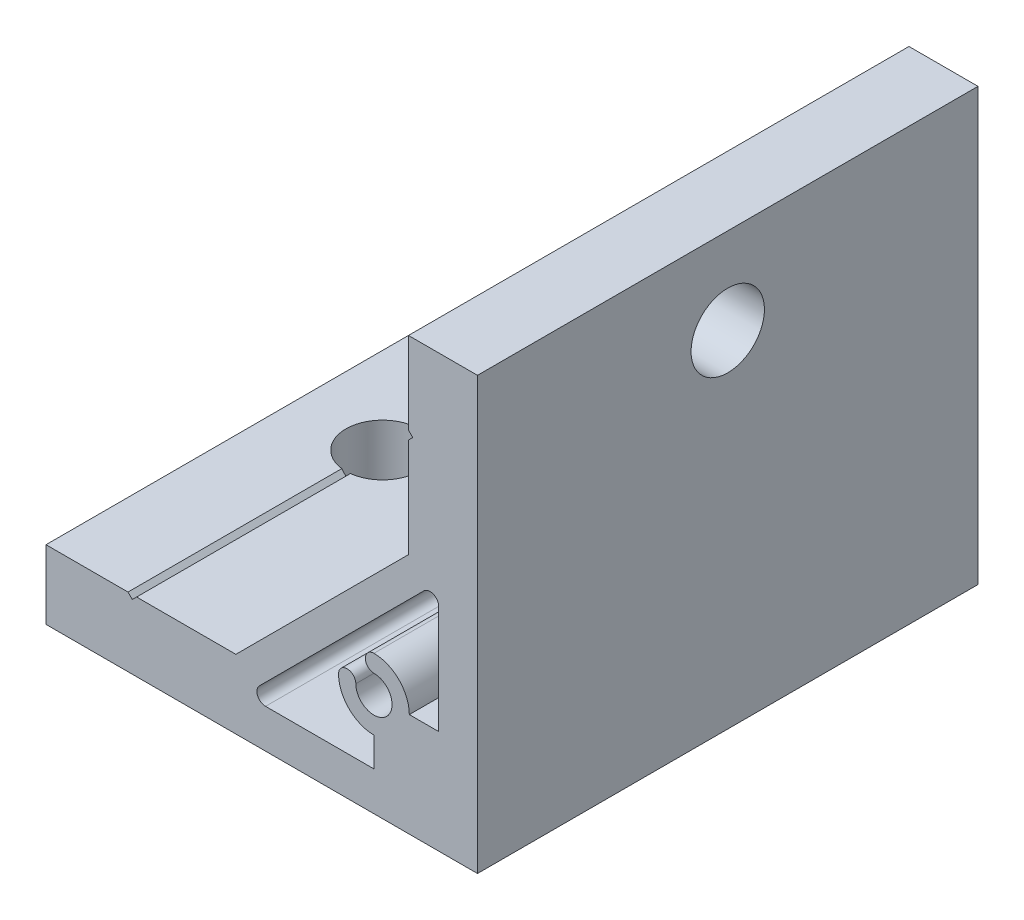
ISO-10303-21;
HEADER;
FILE_DESCRIPTION(('STEP AP214'),'2;1');
FILE_NAME('part.step','',(''),(''),'','','');
FILE_SCHEMA(('AUTOMOTIVE_DESIGN { 1 0 10303 214 1 1 1 1 }'));
ENDSEC;
DATA;
#1=APPLICATION_CONTEXT('core data for automotive mechanical design processes');
#2=APPLICATION_PROTOCOL_DEFINITION('international standard','automotive_design',2000,#1);
#3=PRODUCT_CONTEXT('',#1,'mechanical');
#4=PRODUCT('Part','Part','',(#3));
#5=PRODUCT_RELATED_PRODUCT_CATEGORY('part','',(#4));
#6=PRODUCT_DEFINITION_FORMATION('','',#4);
#7=PRODUCT_DEFINITION_CONTEXT('part definition',#1,'design');
#8=PRODUCT_DEFINITION('design','',#6,#7);
#9=PRODUCT_DEFINITION_SHAPE('','',#8);
#10=(LENGTH_UNIT() NAMED_UNIT(*) SI_UNIT(.MILLI.,.METRE.));
#11=(NAMED_UNIT(*) PLANE_ANGLE_UNIT() SI_UNIT($,.RADIAN.));
#12=(NAMED_UNIT(*) SI_UNIT($,.STERADIAN.) SOLID_ANGLE_UNIT());
#13=UNCERTAINTY_MEASURE_WITH_UNIT(LENGTH_MEASURE(1.E-05),#10,'distance_accuracy_value','');
#14=(GEOMETRIC_REPRESENTATION_CONTEXT(3) GLOBAL_UNCERTAINTY_ASSIGNED_CONTEXT((#13)) GLOBAL_UNIT_ASSIGNED_CONTEXT((#10,
#11,#12)) REPRESENTATION_CONTEXT('',''));
#15=CARTESIAN_POINT('',(0.,0.,0.));
#16=DIRECTION('',(0.,0.,1.));
#17=DIRECTION('',(1.,0.,0.));
#18=AXIS2_PLACEMENT_3D('',#15,#16,#17);
#19=CARTESIAN_POINT('',(-39.5,8.00000000000008,29.));
#20=DIRECTION('',(0.707106781186547,-0.707106781186547,0.));
#21=DIRECTION('',(0.707106781186548,0.707106781186548,0.));
#22=AXIS2_PLACEMENT_3D('',#19,#20,#21);
#23=PLANE('',#22);
#24=DIRECTION('',(0.,0.,-1.));
#25=VECTOR('',#24,1.);
#26=CARTESIAN_POINT('',(-39.5,8.00000000000008,29.));
#27=LINE('',#26,#25);
#28=CARTESIAN_POINT('',(-39.5,8.00000000000008,29.));
#29=VERTEX_POINT('',#28);
#30=CARTESIAN_POINT('',(-39.5,8.00000000000009,4.22048575403354));
#31=VERTEX_POINT('',#30);
#32=EDGE_CURVE('E264',#29,#31,#27,.T.);
#33=ORIENTED_EDGE('',*,*,#32,.T.);
#34=CARTESIAN_POINT('',(-40.,7.50000000000008,0.));
#35=DIRECTION('',(0.707106781186547,-0.707106781186547,0.));
#36=DIRECTION('',(0.707106781186548,0.707106781186548,0.));
#37=AXIS2_PLACEMENT_3D('',#34,#35,#36);
#38=ELLIPSE('',#37,6.01040764008561,4.25000000000001);
#39=CARTESIAN_POINT('',(-40.,7.50000000000008,4.25000000000001));
#40=VERTEX_POINT('',#39);
#41=EDGE_CURVE('E249',#31,#40,#38,.T.);
#42=ORIENTED_EDGE('',*,*,#41,.T.);
#43=DIRECTION('',(0.,0.,-1.));
#44=VECTOR('',#43,1.);
#45=CARTESIAN_POINT('',(-40.,7.50000000000008,29.));
#46=LINE('',#45,#44);
#47=CARTESIAN_POINT('',(-40.,7.50000000000008,29.));
#48=VERTEX_POINT('',#47);
#49=EDGE_CURVE('E248',#48,#40,#46,.T.);
#50=ORIENTED_EDGE('',*,*,#49,.F.);
#51=DIRECTION('',(-0.707106781186547,-0.707106781186547,0.));
#52=VECTOR('',#51,1.);
#53=CARTESIAN_POINT('',(-39.5,8.00000000000008,29.));
#54=LINE('',#53,#52);
#55=EDGE_CURVE('E365',#29,#48,#54,.T.);
#56=ORIENTED_EDGE('',*,*,#55,.F.);
#57=EDGE_LOOP('',(#33,#42,#50,#56));
#58=FACE_BOUND('',#57,.T.);
#59=ADVANCED_FACE('F34',(#58),#23,.F.);
#60=CARTESIAN_POINT('',(-40.,7.50000000000008,29.));
#61=DIRECTION('',(-0.707106781186549,-0.707106781186546,0.));
#62=DIRECTION('',(0.707106781186546,-0.707106781186549,0.));
#63=AXIS2_PLACEMENT_3D('',#60,#61,#62);
#64=PLANE('',#63);
#65=DIRECTION('',(0.,0.,-1.));
#66=VECTOR('',#65,1.);
#67=CARTESIAN_POINT('',(-40.5,8.00000000000008,29.));
#68=LINE('',#67,#66);
#69=CARTESIAN_POINT('',(-40.5,8.00000000000008,-4.22048575403354));
#70=VERTEX_POINT('',#69);
#71=CARTESIAN_POINT('',(-40.5,8.00000000000008,-29.));
#72=VERTEX_POINT('',#71);
#73=EDGE_CURVE('E256',#70,#72,#68,.T.);
#74=ORIENTED_EDGE('',*,*,#73,.F.);
#75=CARTESIAN_POINT('',(-40.,7.50000000000007,0.));
#76=DIRECTION('',(-0.707106781186549,-0.707106781186546,0.));
#77=DIRECTION('',(-0.707106781186546,0.707106781186549,0.));
#78=AXIS2_PLACEMENT_3D('',#75,#76,#77);
#79=ELLIPSE('',#78,6.01040764008572,4.25000000000001);
#80=CARTESIAN_POINT('',(-40.,7.50000000000008,-4.25));
#81=VERTEX_POINT('',#80);
#82=EDGE_CURVE('E49',#70,#81,#79,.T.);
#83=ORIENTED_EDGE('',*,*,#82,.T.);
#84=CARTESIAN_POINT('',(-40.,7.50000000000008,-29.));
#85=VERTEX_POINT('',#84);
#86=EDGE_CURVE('E255',#81,#85,#46,.T.);
#87=ORIENTED_EDGE('',*,*,#86,.T.);
#88=DIRECTION('',(-0.707106781186546,0.707106781186549,0.));
#89=VECTOR('',#88,1.);
#90=CARTESIAN_POINT('',(-40.,7.50000000000008,-29.));
#91=LINE('',#90,#89);
#92=EDGE_CURVE('E332',#85,#72,#91,.T.);
#93=ORIENTED_EDGE('',*,*,#92,.T.);
#94=EDGE_LOOP('',(#74,#83,#87,#93));
#95=FACE_BOUND('',#94,.T.);
#96=ADVANCED_FACE('F414',(#95),#64,.F.);
#97=CARTESIAN_POINT('',(-8.00000000000042,40.5,29.));
#98=DIRECTION('',(0.707106781186549,0.707106781186546,0.));
#99=DIRECTION('',(-0.707106781186546,0.707106781186549,0.));
#100=AXIS2_PLACEMENT_3D('',#97,#98,#99);
#101=PLANE('',#100);
#102=DIRECTION('',(0.,0.,-1.));
#103=VECTOR('',#102,1.);
#104=CARTESIAN_POINT('',(-8.00000000000042,40.5,29.));
#105=LINE('',#104,#103);
#106=CARTESIAN_POINT('',(-8.00000000000042,40.5,29.));
#107=VERTEX_POINT('',#106);
#108=CARTESIAN_POINT('',(-8.00000000000042,40.5,4.22048575403354));
#109=VERTEX_POINT('',#108);
#110=EDGE_CURVE('E282',#107,#109,#105,.T.);
#111=ORIENTED_EDGE('',*,*,#110,.T.);
#112=CARTESIAN_POINT('',(-7.50000000000042,40.,0.));
#113=DIRECTION('',(0.707106781186549,0.707106781186546,0.));
#114=DIRECTION('',(-0.707106781186546,0.707106781186549,0.));
#115=AXIS2_PLACEMENT_3D('',#112,#113,#114);
#116=ELLIPSE('',#115,6.01040764008585,4.25);
#117=CARTESIAN_POINT('',(-7.50000000000042,40.,4.25));
#118=VERTEX_POINT('',#117);
#119=EDGE_CURVE('E452',#109,#118,#116,.T.);
#120=ORIENTED_EDGE('',*,*,#119,.T.);
#121=DIRECTION('',(0.,0.,-1.));
#122=VECTOR('',#121,1.);
#123=CARTESIAN_POINT('',(-7.50000000000042,40.,29.));
#124=LINE('',#123,#122);
#125=CARTESIAN_POINT('',(-7.50000000000042,40.,29.));
#126=VERTEX_POINT('',#125);
#127=EDGE_CURVE('E278',#126,#118,#124,.T.);
#128=ORIENTED_EDGE('',*,*,#127,.F.);
#129=DIRECTION('',(0.707106781186546,-0.707106781186549,0.));
#130=VECTOR('',#129,1.);
#131=CARTESIAN_POINT('',(-8.00000000000042,40.5,29.));
#132=LINE('',#131,#130);
#133=EDGE_CURVE('E355',#107,#126,#132,.T.);
#134=ORIENTED_EDGE('',*,*,#133,.F.);
#135=EDGE_LOOP('',(#111,#120,#128,#134));
#136=FACE_BOUND('',#135,.T.);
#137=ADVANCED_FACE('F421',(#136),#101,.F.);
#138=CARTESIAN_POINT('',(-7.50000000000042,40.,29.));
#139=DIRECTION('',(0.707106781186549,-0.707106781186546,0.));
#140=DIRECTION('',(0.707106781186546,0.707106781186549,0.));
#141=AXIS2_PLACEMENT_3D('',#138,#139,#140);
#142=PLANE('',#141);
#143=DIRECTION('',(0.,0.,-1.));
#144=VECTOR('',#143,1.);
#145=CARTESIAN_POINT('',(-8.00000000000042,39.5,29.));
#146=LINE('',#145,#144);
#147=CARTESIAN_POINT('',(-8.00000000000042,39.5,-4.22048575403353));
#148=VERTEX_POINT('',#147);
#149=CARTESIAN_POINT('',(-8.00000000000042,39.5,-29.));
#150=VERTEX_POINT('',#149);
#151=EDGE_CURVE('E273',#148,#150,#146,.T.);
#152=ORIENTED_EDGE('',*,*,#151,.F.);
#153=CARTESIAN_POINT('',(-7.50000000000043,40.,0.));
#154=DIRECTION('',(0.707106781186549,-0.707106781186546,0.));
#155=DIRECTION('',(-0.707106781186546,-0.707106781186549,0.));
#156=AXIS2_PLACEMENT_3D('',#153,#154,#155);
#157=ELLIPSE('',#156,6.01040764008544,4.25);
#158=CARTESIAN_POINT('',(-7.50000000000042,40.,-4.24999999999999));
#159=VERTEX_POINT('',#158);
#160=EDGE_CURVE('E56',#148,#159,#157,.T.);
#161=ORIENTED_EDGE('',*,*,#160,.T.);
#162=CARTESIAN_POINT('',(-7.50000000000042,40.,-29.));
#163=VERTEX_POINT('',#162);
#164=EDGE_CURVE('E277',#159,#163,#124,.T.);
#165=ORIENTED_EDGE('',*,*,#164,.T.);
#166=DIRECTION('',(-0.707106781186546,-0.707106781186549,0.));
#167=VECTOR('',#166,1.);
#168=CARTESIAN_POINT('',(-7.50000000000042,40.,-29.));
#169=LINE('',#168,#167);
#170=EDGE_CURVE('E307',#163,#150,#169,.T.);
#171=ORIENTED_EDGE('',*,*,#170,.T.);
#172=EDGE_LOOP('',(#152,#161,#165,#171));
#173=FACE_BOUND('',#172,.T.);
#174=ADVANCED_FACE('F304',(#173),#142,.F.);
#175=CARTESIAN_POINT('',(0.,0.,29.));
#176=DIRECTION('',(0.,0.,1.));
#177=DIRECTION('',(1.,0.,0.));
#178=AXIS2_PLACEMENT_3D('',#175,#176,#177);
#179=PLANE('',#178);
#180=DIRECTION('',(0.,-1.,0.));
#181=VECTOR('',#180,1.);
#182=CARTESIAN_POINT('',(-50.,8.,29.));
#183=LINE('',#182,#181);
#184=CARTESIAN_POINT('',(-50.,8.,29.));
#185=VERTEX_POINT('',#184);
#186=CARTESIAN_POINT('',(-50.,0.,29.));
#187=VERTEX_POINT('',#186);
#188=EDGE_CURVE('E335',#185,#187,#183,.T.);
#189=ORIENTED_EDGE('',*,*,#188,.T.);
#190=DIRECTION('',(1.,0.,0.));
#191=VECTOR('',#190,1.);
#192=CARTESIAN_POINT('',(-50.,0.,29.));
#193=LINE('',#192,#191);
#194=CARTESIAN_POINT('',(0.,0.,29.));
#195=VERTEX_POINT('',#194);
#196=EDGE_CURVE('E339',#187,#195,#193,.T.);
#197=ORIENTED_EDGE('',*,*,#196,.T.);
#198=DIRECTION('',(0.,1.,0.));
#199=VECTOR('',#198,1.);
#200=CARTESIAN_POINT('',(0.,0.,29.));
#201=LINE('',#200,#199);
#202=CARTESIAN_POINT('',(0.,50.,29.));
#203=VERTEX_POINT('',#202);
#204=EDGE_CURVE('E344',#195,#203,#201,.T.);
#205=ORIENTED_EDGE('',*,*,#204,.T.);
#206=DIRECTION('',(-1.,0.,0.));
#207=VECTOR('',#206,1.);
#208=CARTESIAN_POINT('',(0.,50.,29.));
#209=LINE('',#208,#207);
#210=CARTESIAN_POINT('',(-8.00000000000009,50.,29.));
#211=VERTEX_POINT('',#210);
#212=EDGE_CURVE('E351',#203,#211,#209,.T.);
#213=ORIENTED_EDGE('',*,*,#212,.T.);
#214=DIRECTION('',(0.,-1.,0.));
#215=VECTOR('',#214,1.);
#216=CARTESIAN_POINT('',(-8.00000000000009,50.,29.));
#217=LINE('',#216,#215);
#218=EDGE_CURVE('E353',#211,#107,#217,.T.);
#219=ORIENTED_EDGE('',*,*,#218,.T.);
#220=ORIENTED_EDGE('',*,*,#133,.T.);
#221=DIRECTION('',(-0.707106781186546,-0.707106781186549,0.));
#222=VECTOR('',#221,1.);
#223=CARTESIAN_POINT('',(-7.50000000000042,40.,29.));
#224=LINE('',#223,#222);
#225=CARTESIAN_POINT('',(-8.00000000000042,39.5,29.));
#226=VERTEX_POINT('',#225);
#227=EDGE_CURVE('E357',#126,#226,#224,.T.);
#228=ORIENTED_EDGE('',*,*,#227,.T.);
#229=DIRECTION('',(0.,-1.,0.));
#230=VECTOR('',#229,1.);
#231=CARTESIAN_POINT('',(-8.00000000000042,39.5,29.));
#232=LINE('',#231,#230);
#233=CARTESIAN_POINT('',(-8.00000000000017,28.,29.));
#234=VERTEX_POINT('',#233);
#235=EDGE_CURVE('E359',#226,#234,#232,.T.);
#236=ORIENTED_EDGE('',*,*,#235,.T.);
#237=DIRECTION('',(-0.707106781186546,-0.707106781186549,0.));
#238=VECTOR('',#237,1.);
#239=CARTESIAN_POINT('',(-8.00000000000017,28.,29.));
#240=LINE('',#239,#238);
#241=CARTESIAN_POINT('',(-28.,8.00000000000008,29.));
#242=VERTEX_POINT('',#241);
#243=EDGE_CURVE('E361',#234,#242,#240,.T.);
#244=ORIENTED_EDGE('',*,*,#243,.T.);
#245=DIRECTION('',(-1.,0.,0.));
#246=VECTOR('',#245,1.);
#247=CARTESIAN_POINT('',(-28.,8.00000000000008,29.));
#248=LINE('',#247,#246);
#249=EDGE_CURVE('E363',#242,#29,#248,.T.);
#250=ORIENTED_EDGE('',*,*,#249,.T.);
#251=ORIENTED_EDGE('',*,*,#55,.T.);
#252=DIRECTION('',(-0.707106781186546,0.707106781186549,0.));
#253=VECTOR('',#252,1.);
#254=CARTESIAN_POINT('',(-40.,7.50000000000008,29.));
#255=LINE('',#254,#253);
#256=CARTESIAN_POINT('',(-40.5,8.00000000000008,29.));
#257=VERTEX_POINT('',#256);
#258=EDGE_CURVE('E367',#48,#257,#255,.T.);
#259=ORIENTED_EDGE('',*,*,#258,.T.);
#260=DIRECTION('',(-1.,0.,0.));
#261=VECTOR('',#260,1.);
#262=CARTESIAN_POINT('',(-40.5,8.00000000000008,29.));
#263=LINE('',#262,#261);
#264=EDGE_CURVE('E254',#257,#185,#263,.T.);
#265=ORIENTED_EDGE('',*,*,#264,.T.);
#266=EDGE_LOOP('',(#189,#197,#205,#213,#219,#220,#228,#236,#244,#250,#251,#259,#265));
#267=FACE_BOUND('',#266,.T.);
#268=DIRECTION('',(0.,1.,0.));
#269=VECTOR('',#268,1.);
#270=CARTESIAN_POINT('',(-4.5,12.,29.));
#271=LINE('',#270,#269);
#272=CARTESIAN_POINT('',(-4.5,12.,29.));
#273=VERTEX_POINT('',#272);
#274=CARTESIAN_POINT('',(-4.5,24.5603030380332,29.));
#275=VERTEX_POINT('',#274);
#276=EDGE_CURVE('E458',#273,#275,#271,.T.);
#277=ORIENTED_EDGE('',*,*,#276,.F.);
#278=DIRECTION('',(1.,0.,0.));
#279=VECTOR('',#278,1.);
#280=CARTESIAN_POINT('',(-7.9,12.,29.));
#281=LINE('',#280,#279);
#282=CARTESIAN_POINT('',(-7.9,12.,29.));
#283=VERTEX_POINT('',#282);
#284=EDGE_CURVE('E456',#283,#273,#281,.T.);
#285=ORIENTED_EDGE('',*,*,#284,.F.);
#286=CARTESIAN_POINT('',(-12.,12.,29.));
#287=DIRECTION('',(0.,0.,-1.));
#288=DIRECTION('',(-1.,0.,0.));
#289=AXIS2_PLACEMENT_3D('',#286,#287,#288);
#290=CIRCLE('',#289,4.1);
#291=CARTESIAN_POINT('',(-12.,16.1,29.));
#292=VERTEX_POINT('',#291);
#293=EDGE_CURVE('E480',#292,#283,#290,.T.);
#294=ORIENTED_EDGE('',*,*,#293,.F.);
#295=CARTESIAN_POINT('',(-12.,15.1,29.));
#296=DIRECTION('',(0.,0.,-1.));
#297=DIRECTION('',(-1.,0.,0.));
#298=AXIS2_PLACEMENT_3D('',#295,#296,#297);
#299=CIRCLE('',#298,1.);
#300=CARTESIAN_POINT('',(-12.,14.1,29.));
#301=VERTEX_POINT('',#300);
#302=EDGE_CURVE('E477',#301,#292,#299,.T.);
#303=ORIENTED_EDGE('',*,*,#302,.F.);
#304=CARTESIAN_POINT('',(-12.,12.,29.));
#305=DIRECTION('',(0.,0.,1.));
#306=DIRECTION('',(1.,0.,0.));
#307=AXIS2_PLACEMENT_3D('',#304,#305,#306);
#308=CIRCLE('',#307,2.1);
#309=CARTESIAN_POINT('',(-14.1,12.,29.));
#310=VERTEX_POINT('',#309);
#311=EDGE_CURVE('E475',#310,#301,#308,.T.);
#312=ORIENTED_EDGE('',*,*,#311,.F.);
#313=CARTESIAN_POINT('',(-15.1,12.,29.));
#314=DIRECTION('',(0.,0.,-1.));
#315=DIRECTION('',(-1.,0.,0.));
#316=AXIS2_PLACEMENT_3D('',#313,#314,#315);
#317=CIRCLE('',#316,1.);
#318=CARTESIAN_POINT('',(-16.1,12.,29.));
#319=VERTEX_POINT('',#318);
#320=EDGE_CURVE('E473',#319,#310,#317,.T.);
#321=ORIENTED_EDGE('',*,*,#320,.F.);
#322=CARTESIAN_POINT('',(-12.,12.,29.));
#323=DIRECTION('',(0.,0.,-1.));
#324=DIRECTION('',(-1.,0.,0.));
#325=AXIS2_PLACEMENT_3D('',#322,#323,#324);
#326=CIRCLE('',#325,4.1);
#327=CARTESIAN_POINT('',(-12.,7.9,29.));
#328=VERTEX_POINT('',#327);
#329=EDGE_CURVE('E471',#328,#319,#326,.T.);
#330=ORIENTED_EDGE('',*,*,#329,.F.);
#331=DIRECTION('',(0.,1.,0.));
#332=VECTOR('',#331,1.);
#333=CARTESIAN_POINT('',(-12.,4.5,29.));
#334=LINE('',#333,#332);
#335=CARTESIAN_POINT('',(-12.,4.5,29.));
#336=VERTEX_POINT('',#335);
#337=EDGE_CURVE('E469',#336,#328,#334,.T.);
#338=ORIENTED_EDGE('',*,*,#337,.F.);
#339=DIRECTION('',(1.,0.,0.));
#340=VECTOR('',#339,1.);
#341=CARTESIAN_POINT('',(-24.5603030380331,4.5,29.));
#342=LINE('',#341,#340);
#343=CARTESIAN_POINT('',(-24.5603030380331,4.5,29.));
#344=VERTEX_POINT('',#343);
#345=EDGE_CURVE('E467',#344,#336,#342,.T.);
#346=ORIENTED_EDGE('',*,*,#345,.F.);
#347=CARTESIAN_POINT('',(-24.5603030380331,5.5,29.));
#348=DIRECTION('',(0.,0.,1.));
#349=DIRECTION('',(1.,0.,0.));
#350=AXIS2_PLACEMENT_3D('',#347,#348,#349);
#351=CIRCLE('',#350,1.);
#352=CARTESIAN_POINT('',(-25.2674098192196,6.20710678118655,29.));
#353=VERTEX_POINT('',#352);
#354=EDGE_CURVE('E465',#353,#344,#351,.T.);
#355=ORIENTED_EDGE('',*,*,#354,.F.);
#356=DIRECTION('',(-0.707106781186546,-0.707106781186549,0.));
#357=VECTOR('',#356,1.);
#358=CARTESIAN_POINT('',(-6.20710678118655,25.2674098192197,29.));
#359=LINE('',#358,#357);
#360=CARTESIAN_POINT('',(-6.20710678118655,25.2674098192197,29.));
#361=VERTEX_POINT('',#360);
#362=EDGE_CURVE('E463',#361,#353,#359,.T.);
#363=ORIENTED_EDGE('',*,*,#362,.F.);
#364=CARTESIAN_POINT('',(-5.5,24.5603030380332,29.));
#365=DIRECTION('',(0.,0.,1.));
#366=DIRECTION('',(1.,0.,0.));
#367=AXIS2_PLACEMENT_3D('',#364,#365,#366);
#368=CIRCLE('',#367,0.999999999999999);
#369=EDGE_CURVE('E461',#275,#361,#368,.T.);
#370=ORIENTED_EDGE('',*,*,#369,.F.);
#371=EDGE_LOOP('',(#277,#285,#294,#303,#312,#321,#330,#338,#346,#355,#363,#370));
#372=FACE_BOUND('',#371,.T.);
#373=ADVANCED_FACE('F411',(#267,#372),#179,.T.);
#374=CARTESIAN_POINT('',(0.,0.,-29.));
#375=DIRECTION('',(0.,0.,1.));
#376=DIRECTION('',(1.,0.,0.));
#377=AXIS2_PLACEMENT_3D('',#374,#375,#376);
#378=PLANE('',#377);
#379=DIRECTION('',(0.,-1.,0.));
#380=VECTOR('',#379,1.);
#381=CARTESIAN_POINT('',(-50.,8.,-29.));
#382=LINE('',#381,#380);
#383=CARTESIAN_POINT('',(-50.,8.,-29.));
#384=VERTEX_POINT('',#383);
#385=CARTESIAN_POINT('',(-50.,0.,-29.));
#386=VERTEX_POINT('',#385);
#387=EDGE_CURVE('E370',#384,#386,#382,.T.);
#388=ORIENTED_EDGE('',*,*,#387,.F.);
#389=DIRECTION('',(-1.,0.,0.));
#390=VECTOR('',#389,1.);
#391=CARTESIAN_POINT('',(-40.5,8.00000000000008,-29.));
#392=LINE('',#391,#390);
#393=EDGE_CURVE('E334',#72,#384,#392,.T.);
#394=ORIENTED_EDGE('',*,*,#393,.F.);
#395=ORIENTED_EDGE('',*,*,#92,.F.);
#396=DIRECTION('',(-0.707106781186547,-0.707106781186547,0.));
#397=VECTOR('',#396,1.);
#398=CARTESIAN_POINT('',(-39.5,8.00000000000008,-29.));
#399=LINE('',#398,#397);
#400=CARTESIAN_POINT('',(-39.5,8.00000000000008,-29.));
#401=VERTEX_POINT('',#400);
#402=EDGE_CURVE('E329',#401,#85,#399,.T.);
#403=ORIENTED_EDGE('',*,*,#402,.F.);
#404=DIRECTION('',(-1.,0.,0.));
#405=VECTOR('',#404,1.);
#406=CARTESIAN_POINT('',(-28.,8.00000000000008,-29.));
#407=LINE('',#406,#405);
#408=CARTESIAN_POINT('',(-28.,8.00000000000008,-29.));
#409=VERTEX_POINT('',#408);
#410=EDGE_CURVE('E323',#409,#401,#407,.T.);
#411=ORIENTED_EDGE('',*,*,#410,.F.);
#412=DIRECTION('',(-0.707106781186546,-0.707106781186549,0.));
#413=VECTOR('',#412,1.);
#414=CARTESIAN_POINT('',(-8.00000000000017,28.,-29.));
#415=LINE('',#414,#413);
#416=CARTESIAN_POINT('',(-8.00000000000017,28.,-29.));
#417=VERTEX_POINT('',#416);
#418=EDGE_CURVE('E320',#417,#409,#415,.T.);
#419=ORIENTED_EDGE('',*,*,#418,.F.);
#420=DIRECTION('',(0.,-1.,0.));
#421=VECTOR('',#420,1.);
#422=CARTESIAN_POINT('',(-8.00000000000042,39.5,-29.));
#423=LINE('',#422,#421);
#424=EDGE_CURVE('E312',#150,#417,#423,.T.);
#425=ORIENTED_EDGE('',*,*,#424,.F.);
#426=ORIENTED_EDGE('',*,*,#170,.F.);
#427=DIRECTION('',(0.707106781186546,-0.707106781186549,0.));
#428=VECTOR('',#427,1.);
#429=CARTESIAN_POINT('',(-8.00000000000042,40.5,-29.));
#430=LINE('',#429,#428);
#431=CARTESIAN_POINT('',(-8.00000000000042,40.5,-29.));
#432=VERTEX_POINT('',#431);
#433=EDGE_CURVE('E313',#432,#163,#430,.T.);
#434=ORIENTED_EDGE('',*,*,#433,.F.);
#435=DIRECTION('',(0.,-1.,0.));
#436=VECTOR('',#435,1.);
#437=CARTESIAN_POINT('',(-8.00000000000009,50.,-29.));
#438=LINE('',#437,#436);
#439=CARTESIAN_POINT('',(-8.00000000000009,50.,-29.));
#440=VERTEX_POINT('',#439);
#441=EDGE_CURVE('E379',#440,#432,#438,.T.);
#442=ORIENTED_EDGE('',*,*,#441,.F.);
#443=DIRECTION('',(-1.,0.,0.));
#444=VECTOR('',#443,1.);
#445=CARTESIAN_POINT('',(0.,50.,-29.));
#446=LINE('',#445,#444);
#447=CARTESIAN_POINT('',(0.,50.,-29.));
#448=VERTEX_POINT('',#447);
#449=EDGE_CURVE('E377',#448,#440,#446,.T.);
#450=ORIENTED_EDGE('',*,*,#449,.F.);
#451=DIRECTION('',(0.,1.,0.));
#452=VECTOR('',#451,1.);
#453=CARTESIAN_POINT('',(0.,0.,-29.));
#454=LINE('',#453,#452);
#455=CARTESIAN_POINT('',(0.,0.,-29.));
#456=VERTEX_POINT('',#455);
#457=EDGE_CURVE('E375',#456,#448,#454,.T.);
#458=ORIENTED_EDGE('',*,*,#457,.F.);
#459=DIRECTION('',(1.,0.,0.));
#460=VECTOR('',#459,1.);
#461=CARTESIAN_POINT('',(-50.,0.,-29.));
#462=LINE('',#461,#460);
#463=EDGE_CURVE('E373',#386,#456,#462,.T.);
#464=ORIENTED_EDGE('',*,*,#463,.F.);
#465=EDGE_LOOP('',(#388,#394,#395,#403,#411,#419,#425,#426,#434,#442,#450,#458,#464));
#466=FACE_BOUND('',#465,.T.);
#467=DIRECTION('',(1.,0.,0.));
#468=VECTOR('',#467,1.);
#469=CARTESIAN_POINT('',(-7.9,12.,-29.));
#470=LINE('',#469,#468);
#471=CARTESIAN_POINT('',(-7.9,12.,-29.));
#472=VERTEX_POINT('',#471);
#473=CARTESIAN_POINT('',(-4.5,12.,-29.));
#474=VERTEX_POINT('',#473);
#475=EDGE_CURVE('E483',#472,#474,#470,.T.);
#476=ORIENTED_EDGE('',*,*,#475,.T.);
#477=DIRECTION('',(0.,1.,0.));
#478=VECTOR('',#477,1.);
#479=CARTESIAN_POINT('',(-4.5,12.,-29.));
#480=LINE('',#479,#478);
#481=CARTESIAN_POINT('',(-4.5,24.5603030380332,-29.));
#482=VERTEX_POINT('',#481);
#483=EDGE_CURVE('E486',#474,#482,#480,.T.);
#484=ORIENTED_EDGE('',*,*,#483,.T.);
#485=CARTESIAN_POINT('',(-5.5,24.5603030380332,-29.));
#486=DIRECTION('',(0.,0.,1.));
#487=DIRECTION('',(1.,0.,0.));
#488=AXIS2_PLACEMENT_3D('',#485,#486,#487);
#489=CIRCLE('',#488,0.999999999999999);
#490=CARTESIAN_POINT('',(-6.20710678118655,25.2674098192197,-29.));
#491=VERTEX_POINT('',#490);
#492=EDGE_CURVE('E489',#482,#491,#489,.T.);
#493=ORIENTED_EDGE('',*,*,#492,.T.);
#494=DIRECTION('',(-0.707106781186546,-0.707106781186549,0.));
#495=VECTOR('',#494,1.);
#496=CARTESIAN_POINT('',(-6.20710678118655,25.2674098192197,-29.));
#497=LINE('',#496,#495);
#498=CARTESIAN_POINT('',(-25.2674098192196,6.20710678118655,-29.));
#499=VERTEX_POINT('',#498);
#500=EDGE_CURVE('E492',#491,#499,#497,.T.);
#501=ORIENTED_EDGE('',*,*,#500,.T.);
#502=CARTESIAN_POINT('',(-24.5603030380331,5.5,-29.));
#503=DIRECTION('',(0.,0.,1.));
#504=DIRECTION('',(1.,0.,0.));
#505=AXIS2_PLACEMENT_3D('',#502,#503,#504);
#506=CIRCLE('',#505,1.);
#507=CARTESIAN_POINT('',(-24.5603030380331,4.5,-29.));
#508=VERTEX_POINT('',#507);
#509=EDGE_CURVE('E495',#499,#508,#506,.T.);
#510=ORIENTED_EDGE('',*,*,#509,.T.);
#511=DIRECTION('',(1.,0.,0.));
#512=VECTOR('',#511,1.);
#513=CARTESIAN_POINT('',(-24.5603030380331,4.5,-29.));
#514=LINE('',#513,#512);
#515=CARTESIAN_POINT('',(-12.,4.5,-29.));
#516=VERTEX_POINT('',#515);
#517=EDGE_CURVE('E498',#508,#516,#514,.T.);
#518=ORIENTED_EDGE('',*,*,#517,.T.);
#519=DIRECTION('',(0.,1.,0.));
#520=VECTOR('',#519,1.);
#521=CARTESIAN_POINT('',(-12.,4.5,-29.));
#522=LINE('',#521,#520);
#523=CARTESIAN_POINT('',(-12.,7.9,-29.));
#524=VERTEX_POINT('',#523);
#525=EDGE_CURVE('E501',#516,#524,#522,.T.);
#526=ORIENTED_EDGE('',*,*,#525,.T.);
#527=CARTESIAN_POINT('',(-12.,12.,-29.));
#528=DIRECTION('',(0.,0.,-1.));
#529=DIRECTION('',(-1.,0.,0.));
#530=AXIS2_PLACEMENT_3D('',#527,#528,#529);
#531=CIRCLE('',#530,4.1);
#532=CARTESIAN_POINT('',(-16.1,12.,-29.));
#533=VERTEX_POINT('',#532);
#534=EDGE_CURVE('E504',#524,#533,#531,.T.);
#535=ORIENTED_EDGE('',*,*,#534,.T.);
#536=CARTESIAN_POINT('',(-15.1,12.,-29.));
#537=DIRECTION('',(0.,0.,-1.));
#538=DIRECTION('',(-1.,0.,0.));
#539=AXIS2_PLACEMENT_3D('',#536,#537,#538);
#540=CIRCLE('',#539,1.);
#541=CARTESIAN_POINT('',(-14.1,12.,-29.));
#542=VERTEX_POINT('',#541);
#543=EDGE_CURVE('E507',#533,#542,#540,.T.);
#544=ORIENTED_EDGE('',*,*,#543,.T.);
#545=CARTESIAN_POINT('',(-12.,12.,-29.));
#546=DIRECTION('',(0.,0.,1.));
#547=DIRECTION('',(1.,0.,0.));
#548=AXIS2_PLACEMENT_3D('',#545,#546,#547);
#549=CIRCLE('',#548,2.1);
#550=CARTESIAN_POINT('',(-12.,14.1,-29.));
#551=VERTEX_POINT('',#550);
#552=EDGE_CURVE('E510',#542,#551,#549,.T.);
#553=ORIENTED_EDGE('',*,*,#552,.T.);
#554=CARTESIAN_POINT('',(-12.,15.1,-29.));
#555=DIRECTION('',(0.,0.,-1.));
#556=DIRECTION('',(-1.,0.,0.));
#557=AXIS2_PLACEMENT_3D('',#554,#555,#556);
#558=CIRCLE('',#557,1.);
#559=CARTESIAN_POINT('',(-12.,16.1,-29.));
#560=VERTEX_POINT('',#559);
#561=EDGE_CURVE('E513',#551,#560,#558,.T.);
#562=ORIENTED_EDGE('',*,*,#561,.T.);
#563=CARTESIAN_POINT('',(-12.,12.,-29.));
#564=DIRECTION('',(0.,0.,-1.));
#565=DIRECTION('',(-1.,0.,0.));
#566=AXIS2_PLACEMENT_3D('',#563,#564,#565);
#567=CIRCLE('',#566,4.1);
#568=EDGE_CURVE('E459',#560,#472,#567,.T.);
#569=ORIENTED_EDGE('',*,*,#568,.T.);
#570=EDGE_LOOP('',(#476,#484,#493,#501,#510,#518,#526,#535,#544,#553,#562,#569));
#571=FACE_BOUND('',#570,.T.);
#572=ADVANCED_FACE('F317',(#466,#571),#378,.F.);
#573=CARTESIAN_POINT('',(-50.,8.,29.));
#574=DIRECTION('',(1.,0.,0.));
#575=DIRECTION('',(0.,1.,0.));
#576=AXIS2_PLACEMENT_3D('',#573,#574,#575);
#577=PLANE('',#576);
#578=ORIENTED_EDGE('',*,*,#387,.T.);
#579=DIRECTION('',(0.,0.,-1.));
#580=VECTOR('',#579,1.);
#581=CARTESIAN_POINT('',(-50.,0.,29.));
#582=LINE('',#581,#580);
#583=EDGE_CURVE('E294',#187,#386,#582,.T.);
#584=ORIENTED_EDGE('',*,*,#583,.F.);
#585=ORIENTED_EDGE('',*,*,#188,.F.);
#586=DIRECTION('',(0.,0.,-1.));
#587=VECTOR('',#586,1.);
#588=CARTESIAN_POINT('',(-50.,8.,29.));
#589=LINE('',#588,#587);
#590=EDGE_CURVE('E259',#185,#384,#589,.T.);
#591=ORIENTED_EDGE('',*,*,#590,.T.);
#592=EDGE_LOOP('',(#578,#584,#585,#591));
#593=FACE_BOUND('',#592,.T.);
#594=ADVANCED_FACE('F36',(#593),#577,.F.);
#595=CARTESIAN_POINT('',(-50.,0.,29.));
#596=DIRECTION('',(0.,1.,0.));
#597=DIRECTION('',(-1.,0.,0.));
#598=AXIS2_PLACEMENT_3D('',#595,#596,#597);
#599=PLANE('',#598);
#600=CARTESIAN_POINT('',(-40.,-3.29597460435593E-13,0.));
#601=DIRECTION('',(0.,1.,0.));
#602=DIRECTION('',(-1.,0.,0.));
#603=AXIS2_PLACEMENT_3D('',#600,#601,#602);
#604=CIRCLE('',#603,4.25000000000001);
#605=CARTESIAN_POINT('',(-44.25,-3.64520183044074E-13,0.));
#606=VERTEX_POINT('',#605);
#607=EDGE_CURVE('E250',#606,#606,#604,.T.);
#608=ORIENTED_EDGE('',*,*,#607,.T.);
#609=EDGE_LOOP('',(#608));
#610=FACE_BOUND('',#609,.T.);
#611=ORIENTED_EDGE('',*,*,#463,.T.);
#612=DIRECTION('',(0.,0.,-1.));
#613=VECTOR('',#612,1.);
#614=CARTESIAN_POINT('',(0.,0.,29.));
#615=LINE('',#614,#613);
#616=EDGE_CURVE('E291',#195,#456,#615,.T.);
#617=ORIENTED_EDGE('',*,*,#616,.F.);
#618=ORIENTED_EDGE('',*,*,#196,.F.);
#619=ORIENTED_EDGE('',*,*,#583,.T.);
#620=EDGE_LOOP('',(#611,#617,#618,#619));
#621=FACE_BOUND('',#620,.T.);
#622=ADVANCED_FACE('F403',(#610,#621),#599,.F.);
#623=CARTESIAN_POINT('',(0.,0.,29.));
#624=DIRECTION('',(-1.,0.,0.));
#625=DIRECTION('',(0.,0.,1.));
#626=AXIS2_PLACEMENT_3D('',#623,#624,#625);
#627=PLANE('',#626);
#628=CARTESIAN_POINT('',(1.38777878078145E-12,39.9999999999998,0.));
#629=DIRECTION('',(-1.,0.,0.));
#630=DIRECTION('',(0.,-1.,0.));
#631=AXIS2_PLACEMENT_3D('',#628,#629,#630);
#632=CIRCLE('',#631,4.25);
#633=CARTESIAN_POINT('',(1.24032728532342E-12,35.7499999999998,0.));
#634=VERTEX_POINT('',#633);
#635=EDGE_CURVE('E446',#634,#634,#632,.T.);
#636=ORIENTED_EDGE('',*,*,#635,.T.);
#637=EDGE_LOOP('',(#636));
#638=FACE_BOUND('',#637,.T.);
#639=ORIENTED_EDGE('',*,*,#457,.T.);
#640=DIRECTION('',(0.,0.,-1.));
#641=VECTOR('',#640,1.);
#642=CARTESIAN_POINT('',(0.,50.,29.));
#643=LINE('',#642,#641);
#644=EDGE_CURVE('E288',#203,#448,#643,.T.);
#645=ORIENTED_EDGE('',*,*,#644,.F.);
#646=ORIENTED_EDGE('',*,*,#204,.F.);
#647=ORIENTED_EDGE('',*,*,#616,.T.);
#648=EDGE_LOOP('',(#639,#645,#646,#647));
#649=FACE_BOUND('',#648,.T.);
#650=ADVANCED_FACE('F400',(#638,#649),#627,.F.);
#651=CARTESIAN_POINT('',(0.,50.,29.));
#652=DIRECTION('',(0.,-1.,0.));
#653=DIRECTION('',(0.,0.,-1.));
#654=AXIS2_PLACEMENT_3D('',#651,#652,#653);
#655=PLANE('',#654);
#656=ORIENTED_EDGE('',*,*,#449,.T.);
#657=DIRECTION('',(0.,0.,-1.));
#658=VECTOR('',#657,1.);
#659=CARTESIAN_POINT('',(-8.00000000000009,50.,29.));
#660=LINE('',#659,#658);
#661=EDGE_CURVE('E285',#211,#440,#660,.T.);
#662=ORIENTED_EDGE('',*,*,#661,.F.);
#663=ORIENTED_EDGE('',*,*,#212,.F.);
#664=ORIENTED_EDGE('',*,*,#644,.T.);
#665=EDGE_LOOP('',(#656,#662,#663,#664));
#666=FACE_BOUND('',#665,.T.);
#667=ADVANCED_FACE('F396',(#666),#655,.F.);
#668=CARTESIAN_POINT('',(-8.00000000000009,50.,29.));
#669=DIRECTION('',(1.,0.,0.));
#670=DIRECTION('',(0.,1.,0.));
#671=AXIS2_PLACEMENT_3D('',#668,#669,#670);
#672=PLANE('',#671);
#673=CARTESIAN_POINT('',(-8.00000000000042,40.5,-4.22048575403354));
#674=VERTEX_POINT('',#673);
#675=EDGE_CURVE('E281',#674,#432,#105,.T.);
#676=ORIENTED_EDGE('',*,*,#675,.F.);
#677=CARTESIAN_POINT('',(-8.00000000000044,40.0000000000001,0.));
#678=DIRECTION('',(-1.,0.,0.));
#679=DIRECTION('',(0.,-1.,0.));
#680=AXIS2_PLACEMENT_3D('',#677,#678,#679);
#681=CIRCLE('',#680,4.25);
#682=EDGE_CURVE('E440',#109,#674,#681,.T.);
#683=ORIENTED_EDGE('',*,*,#682,.F.);
#684=ORIENTED_EDGE('',*,*,#110,.F.);
#685=ORIENTED_EDGE('',*,*,#218,.F.);
#686=ORIENTED_EDGE('',*,*,#661,.T.);
#687=ORIENTED_EDGE('',*,*,#441,.T.);
#688=EDGE_LOOP('',(#676,#683,#684,#685,#686,#687));
#689=FACE_BOUND('',#688,.T.);
#690=ADVANCED_FACE('F389',(#689),#672,.F.);
#691=ORIENTED_EDGE('',*,*,#164,.F.);
#692=EDGE_CURVE('E455',#159,#674,#116,.T.);
#693=ORIENTED_EDGE('',*,*,#692,.T.);
#694=ORIENTED_EDGE('',*,*,#675,.T.);
#695=ORIENTED_EDGE('',*,*,#433,.T.);
#696=EDGE_LOOP('',(#691,#693,#694,#695));
#697=FACE_BOUND('',#696,.T.);
#698=ADVANCED_FACE('F382',(#697),#101,.F.);
#699=ORIENTED_EDGE('',*,*,#127,.T.);
#700=CARTESIAN_POINT('',(-8.00000000000046,39.5,4.22048575403353));
#701=VERTEX_POINT('',#700);
#702=EDGE_CURVE('E449',#118,#701,#157,.T.);
#703=ORIENTED_EDGE('',*,*,#702,.T.);
#704=EDGE_CURVE('E274',#226,#701,#146,.T.);
#705=ORIENTED_EDGE('',*,*,#704,.F.);
#706=ORIENTED_EDGE('',*,*,#227,.F.);
#707=EDGE_LOOP('',(#699,#703,#705,#706));
#708=FACE_BOUND('',#707,.T.);
#709=ADVANCED_FACE('F706',(#708),#142,.F.);
#710=CARTESIAN_POINT('',(-8.00000000000042,39.5,29.));
#711=DIRECTION('',(1.,0.,0.));
#712=DIRECTION('',(0.,1.,0.));
#713=AXIS2_PLACEMENT_3D('',#710,#711,#712);
#714=PLANE('',#713);
#715=ORIENTED_EDGE('',*,*,#704,.T.);
#716=CARTESIAN_POINT('',(-8.00000000000043,40.0000000000001,0.));
#717=DIRECTION('',(1.,0.,0.));
#718=DIRECTION('',(0.,1.,0.));
#719=AXIS2_PLACEMENT_3D('',#716,#717,#718);
#720=CIRCLE('',#719,4.25);
#721=EDGE_CURVE('E42',#701,#148,#720,.T.);
#722=ORIENTED_EDGE('',*,*,#721,.T.);
#723=ORIENTED_EDGE('',*,*,#151,.T.);
#724=ORIENTED_EDGE('',*,*,#424,.T.);
#725=DIRECTION('',(0.,0.,-1.));
#726=VECTOR('',#725,1.);
#727=CARTESIAN_POINT('',(-8.00000000000017,28.,29.));
#728=LINE('',#727,#726);
#729=EDGE_CURVE('E270',#234,#417,#728,.T.);
#730=ORIENTED_EDGE('',*,*,#729,.F.);
#731=ORIENTED_EDGE('',*,*,#235,.F.);
#732=EDGE_LOOP('',(#715,#722,#723,#724,#730,#731));
#733=FACE_BOUND('',#732,.T.);
#734=ADVANCED_FACE('F298',(#733),#714,.F.);
#735=CARTESIAN_POINT('',(-8.00000000000017,28.,29.));
#736=DIRECTION('',(0.707106781186549,-0.707106781186546,0.));
#737=DIRECTION('',(0.707106781186546,0.707106781186549,0.));
#738=AXIS2_PLACEMENT_3D('',#735,#736,#737);
#739=PLANE('',#738);
#740=ORIENTED_EDGE('',*,*,#418,.T.);
#741=DIRECTION('',(0.,0.,-1.));
#742=VECTOR('',#741,1.);
#743=CARTESIAN_POINT('',(-28.,8.00000000000008,29.));
#744=LINE('',#743,#742);
#745=EDGE_CURVE('E267',#242,#409,#744,.T.);
#746=ORIENTED_EDGE('',*,*,#745,.F.);
#747=ORIENTED_EDGE('',*,*,#243,.F.);
#748=ORIENTED_EDGE('',*,*,#729,.T.);
#749=EDGE_LOOP('',(#740,#746,#747,#748));
#750=FACE_BOUND('',#749,.T.);
#751=ADVANCED_FACE('F432',(#750),#739,.F.);
#752=CARTESIAN_POINT('',(-28.,8.00000000000008,29.));
#753=DIRECTION('',(0.,-1.,0.));
#754=DIRECTION('',(1.,0.,0.));
#755=AXIS2_PLACEMENT_3D('',#752,#753,#754);
#756=PLANE('',#755);
#757=CARTESIAN_POINT('',(-39.5,8.00000000000009,-4.22048575403354));
#758=VERTEX_POINT('',#757);
#759=EDGE_CURVE('E263',#758,#401,#27,.T.);
#760=ORIENTED_EDGE('',*,*,#759,.F.);
#761=CARTESIAN_POINT('',(-40.,8.00000000000008,0.));
#762=DIRECTION('',(0.,1.,0.));
#763=DIRECTION('',(-1.,0.,0.));
#764=AXIS2_PLACEMENT_3D('',#761,#762,#763);
#765=CIRCLE('',#764,4.25000000000001);
#766=EDGE_CURVE('E443',#31,#758,#765,.T.);
#767=ORIENTED_EDGE('',*,*,#766,.F.);
#768=ORIENTED_EDGE('',*,*,#32,.F.);
#769=ORIENTED_EDGE('',*,*,#249,.F.);
#770=ORIENTED_EDGE('',*,*,#745,.T.);
#771=ORIENTED_EDGE('',*,*,#410,.T.);
#772=EDGE_LOOP('',(#760,#767,#768,#769,#770,#771));
#773=FACE_BOUND('',#772,.T.);
#774=ADVANCED_FACE('F426',(#773),#756,.F.);
#775=ORIENTED_EDGE('',*,*,#86,.F.);
#776=EDGE_CURVE('E436',#81,#758,#38,.T.);
#777=ORIENTED_EDGE('',*,*,#776,.T.);
#778=ORIENTED_EDGE('',*,*,#759,.T.);
#779=ORIENTED_EDGE('',*,*,#402,.T.);
#780=EDGE_LOOP('',(#775,#777,#778,#779));
#781=FACE_BOUND('',#780,.T.);
#782=ADVANCED_FACE('F417',(#781),#23,.F.);
#783=ORIENTED_EDGE('',*,*,#49,.T.);
#784=CARTESIAN_POINT('',(-40.5,8.00000000000008,4.22048575403354));
#785=VERTEX_POINT('',#784);
#786=EDGE_CURVE('E235',#40,#785,#79,.T.);
#787=ORIENTED_EDGE('',*,*,#786,.T.);
#788=EDGE_CURVE('E245',#257,#785,#68,.T.);
#789=ORIENTED_EDGE('',*,*,#788,.F.);
#790=ORIENTED_EDGE('',*,*,#258,.F.);
#791=EDGE_LOOP('',(#783,#787,#789,#790));
#792=FACE_BOUND('',#791,.T.);
#793=ADVANCED_FACE('F243',(#792),#64,.F.);
#794=CARTESIAN_POINT('',(-40.5,8.00000000000008,29.));
#795=DIRECTION('',(0.,-1.,0.));
#796=DIRECTION('',(1.,0.,0.));
#797=AXIS2_PLACEMENT_3D('',#794,#795,#796);
#798=PLANE('',#797);
#799=ORIENTED_EDGE('',*,*,#788,.T.);
#800=CARTESIAN_POINT('',(-40.,8.00000000000008,0.));
#801=DIRECTION('',(0.,-1.,0.));
#802=DIRECTION('',(1.,0.,0.));
#803=AXIS2_PLACEMENT_3D('',#800,#801,#802);
#804=CIRCLE('',#803,4.25000000000001);
#805=EDGE_CURVE('E11',#785,#70,#804,.T.);
#806=ORIENTED_EDGE('',*,*,#805,.T.);
#807=ORIENTED_EDGE('',*,*,#73,.T.);
#808=ORIENTED_EDGE('',*,*,#393,.T.);
#809=ORIENTED_EDGE('',*,*,#590,.F.);
#810=ORIENTED_EDGE('',*,*,#264,.F.);
#811=EDGE_LOOP('',(#799,#806,#807,#808,#809,#810));
#812=FACE_BOUND('',#811,.T.);
#813=ADVANCED_FACE('F252',(#812),#798,.F.);
#814=CARTESIAN_POINT('',(-7.9,12.,29.));
#815=DIRECTION('',(0.,1.,0.));
#816=DIRECTION('',(0.,0.,1.));
#817=AXIS2_PLACEMENT_3D('',#814,#815,#816);
#818=PLANE('',#817);
#819=ORIENTED_EDGE('',*,*,#475,.F.);
#820=DIRECTION('',(0.,0.,-1.));
#821=VECTOR('',#820,1.);
#822=CARTESIAN_POINT('',(-7.9,12.,29.));
#823=LINE('',#822,#821);
#824=EDGE_CURVE('E482',#283,#472,#823,.T.);
#825=ORIENTED_EDGE('',*,*,#824,.F.);
#826=ORIENTED_EDGE('',*,*,#284,.T.);
#827=DIRECTION('',(0.,0.,-1.));
#828=VECTOR('',#827,1.);
#829=CARTESIAN_POINT('',(-4.5,12.,29.));
#830=LINE('',#829,#828);
#831=EDGE_CURVE('E347',#273,#474,#830,.T.);
#832=ORIENTED_EDGE('',*,*,#831,.T.);
#833=EDGE_LOOP('',(#819,#825,#826,#832));
#834=FACE_BOUND('',#833,.T.);
#835=ADVANCED_FACE('F544',(#834),#818,.T.);
#836=CARTESIAN_POINT('',(-4.5,12.,29.));
#837=DIRECTION('',(-1.,0.,0.));
#838=DIRECTION('',(0.,-1.,0.));
#839=AXIS2_PLACEMENT_3D('',#836,#837,#838);
#840=PLANE('',#839);
#841=ORIENTED_EDGE('',*,*,#483,.F.);
#842=ORIENTED_EDGE('',*,*,#831,.F.);
#843=ORIENTED_EDGE('',*,*,#276,.T.);
#844=DIRECTION('',(0.,0.,-1.));
#845=VECTOR('',#844,1.);
#846=CARTESIAN_POINT('',(-4.5,24.5603030380332,29.));
#847=LINE('',#846,#845);
#848=EDGE_CURVE('E537',#275,#482,#847,.T.);
#849=ORIENTED_EDGE('',*,*,#848,.T.);
#850=EDGE_LOOP('',(#841,#842,#843,#849));
#851=FACE_BOUND('',#850,.T.);
#852=ADVANCED_FACE('F557',(#851),#840,.T.);
#853=CARTESIAN_POINT('',(-5.5,24.5603030380332,29.));
#854=DIRECTION('',(0.,0.,-1.));
#855=DIRECTION('',(-1.,0.,0.));
#856=AXIS2_PLACEMENT_3D('',#853,#854,#855);
#857=CYLINDRICAL_SURFACE('',#856,0.999999999999999);
#858=ORIENTED_EDGE('',*,*,#492,.F.);
#859=ORIENTED_EDGE('',*,*,#848,.F.);
#860=ORIENTED_EDGE('',*,*,#369,.T.);
#861=DIRECTION('',(0.,0.,-1.));
#862=VECTOR('',#861,1.);
#863=CARTESIAN_POINT('',(-6.20710678118655,25.2674098192197,29.));
#864=LINE('',#863,#862);
#865=EDGE_CURVE('E536',#361,#491,#864,.T.);
#866=ORIENTED_EDGE('',*,*,#865,.T.);
#867=EDGE_LOOP('',(#858,#859,#860,#866));
#868=FACE_BOUND('',#867,.T.);
#869=ADVANCED_FACE('F559',(#868),#857,.F.);
#870=CARTESIAN_POINT('',(-6.20710678118655,25.2674098192197,29.));
#871=DIRECTION('',(0.707106781186549,-0.707106781186546,0.));
#872=DIRECTION('',(0.707106781186546,0.707106781186549,0.));
#873=AXIS2_PLACEMENT_3D('',#870,#871,#872);
#874=PLANE('',#873);
#875=ORIENTED_EDGE('',*,*,#500,.F.);
#876=ORIENTED_EDGE('',*,*,#865,.F.);
#877=ORIENTED_EDGE('',*,*,#362,.T.);
#878=DIRECTION('',(0.,0.,-1.));
#879=VECTOR('',#878,1.);
#880=CARTESIAN_POINT('',(-25.2674098192196,6.20710678118655,29.));
#881=LINE('',#880,#879);
#882=EDGE_CURVE('E534',#353,#499,#881,.T.);
#883=ORIENTED_EDGE('',*,*,#882,.T.);
#884=EDGE_LOOP('',(#875,#876,#877,#883));
#885=FACE_BOUND('',#884,.T.);
#886=ADVANCED_FACE('F564',(#885),#874,.T.);
#887=CARTESIAN_POINT('',(-24.5603030380331,5.5,29.));
#888=DIRECTION('',(0.,0.,-1.));
#889=DIRECTION('',(-1.,0.,0.));
#890=AXIS2_PLACEMENT_3D('',#887,#888,#889);
#891=CYLINDRICAL_SURFACE('',#890,1.);
#892=ORIENTED_EDGE('',*,*,#509,.F.);
#893=ORIENTED_EDGE('',*,*,#882,.F.);
#894=ORIENTED_EDGE('',*,*,#354,.T.);
#895=DIRECTION('',(0.,0.,-1.));
#896=VECTOR('',#895,1.);
#897=CARTESIAN_POINT('',(-24.5603030380331,4.5,29.));
#898=LINE('',#897,#896);
#899=EDGE_CURVE('E532',#344,#508,#898,.T.);
#900=ORIENTED_EDGE('',*,*,#899,.T.);
#901=EDGE_LOOP('',(#892,#893,#894,#900));
#902=FACE_BOUND('',#901,.T.);
#903=ADVANCED_FACE('F568',(#902),#891,.F.);
#904=CARTESIAN_POINT('',(-24.5603030380331,4.5,29.));
#905=DIRECTION('',(0.,1.,0.));
#906=DIRECTION('',(0.,0.,1.));
#907=AXIS2_PLACEMENT_3D('',#904,#905,#906);
#908=PLANE('',#907);
#909=ORIENTED_EDGE('',*,*,#517,.F.);
#910=ORIENTED_EDGE('',*,*,#899,.F.);
#911=ORIENTED_EDGE('',*,*,#345,.T.);
#912=DIRECTION('',(0.,0.,-1.));
#913=VECTOR('',#912,1.);
#914=CARTESIAN_POINT('',(-12.,4.5,29.));
#915=LINE('',#914,#913);
#916=EDGE_CURVE('E530',#336,#516,#915,.T.);
#917=ORIENTED_EDGE('',*,*,#916,.T.);
#918=EDGE_LOOP('',(#909,#910,#911,#917));
#919=FACE_BOUND('',#918,.T.);
#920=ADVANCED_FACE('F573',(#919),#908,.T.);
#921=CARTESIAN_POINT('',(-12.,4.5,29.));
#922=DIRECTION('',(-1.,0.,0.));
#923=DIRECTION('',(0.,-1.,0.));
#924=AXIS2_PLACEMENT_3D('',#921,#922,#923);
#925=PLANE('',#924);
#926=ORIENTED_EDGE('',*,*,#525,.F.);
#927=ORIENTED_EDGE('',*,*,#916,.F.);
#928=ORIENTED_EDGE('',*,*,#337,.T.);
#929=DIRECTION('',(0.,0.,-1.));
#930=VECTOR('',#929,1.);
#931=CARTESIAN_POINT('',(-12.,7.9,29.));
#932=LINE('',#931,#930);
#933=EDGE_CURVE('E528',#328,#524,#932,.T.);
#934=ORIENTED_EDGE('',*,*,#933,.T.);
#935=EDGE_LOOP('',(#926,#927,#928,#934));
#936=FACE_BOUND('',#935,.T.);
#937=ADVANCED_FACE('F578',(#936),#925,.T.);
#938=CARTESIAN_POINT('',(-12.,12.,29.));
#939=DIRECTION('',(0.,0.,-1.));
#940=DIRECTION('',(-1.,0.,0.));
#941=AXIS2_PLACEMENT_3D('',#938,#939,#940);
#942=CYLINDRICAL_SURFACE('',#941,4.1);
#943=ORIENTED_EDGE('',*,*,#534,.F.);
#944=ORIENTED_EDGE('',*,*,#933,.F.);
#945=ORIENTED_EDGE('',*,*,#329,.T.);
#946=DIRECTION('',(0.,0.,-1.));
#947=VECTOR('',#946,1.);
#948=CARTESIAN_POINT('',(-16.1,12.,29.));
#949=LINE('',#948,#947);
#950=EDGE_CURVE('E526',#319,#533,#949,.T.);
#951=ORIENTED_EDGE('',*,*,#950,.T.);
#952=EDGE_LOOP('',(#943,#944,#945,#951));
#953=FACE_BOUND('',#952,.T.);
#954=ADVANCED_FACE('F583',(#953),#942,.T.);
#955=CARTESIAN_POINT('',(-15.1,12.,29.));
#956=DIRECTION('',(0.,0.,-1.));
#957=DIRECTION('',(-1.,0.,0.));
#958=AXIS2_PLACEMENT_3D('',#955,#956,#957);
#959=CYLINDRICAL_SURFACE('',#958,1.);
#960=ORIENTED_EDGE('',*,*,#543,.F.);
#961=ORIENTED_EDGE('',*,*,#950,.F.);
#962=ORIENTED_EDGE('',*,*,#320,.T.);
#963=DIRECTION('',(0.,0.,-1.));
#964=VECTOR('',#963,1.);
#965=CARTESIAN_POINT('',(-14.1,12.,29.));
#966=LINE('',#965,#964);
#967=EDGE_CURVE('E524',#310,#542,#966,.T.);
#968=ORIENTED_EDGE('',*,*,#967,.T.);
#969=EDGE_LOOP('',(#960,#961,#962,#968));
#970=FACE_BOUND('',#969,.T.);
#971=ADVANCED_FACE('F588',(#970),#959,.T.);
#972=CARTESIAN_POINT('',(-12.,12.,29.));
#973=DIRECTION('',(0.,0.,-1.));
#974=DIRECTION('',(-1.,0.,0.));
#975=AXIS2_PLACEMENT_3D('',#972,#973,#974);
#976=CYLINDRICAL_SURFACE('',#975,2.1);
#977=ORIENTED_EDGE('',*,*,#552,.F.);
#978=ORIENTED_EDGE('',*,*,#967,.F.);
#979=ORIENTED_EDGE('',*,*,#311,.T.);
#980=DIRECTION('',(0.,0.,-1.));
#981=VECTOR('',#980,1.);
#982=CARTESIAN_POINT('',(-12.,14.1,29.));
#983=LINE('',#982,#981);
#984=EDGE_CURVE('E522',#301,#551,#983,.T.);
#985=ORIENTED_EDGE('',*,*,#984,.T.);
#986=EDGE_LOOP('',(#977,#978,#979,#985));
#987=FACE_BOUND('',#986,.T.);
#988=ADVANCED_FACE('F592',(#987),#976,.F.);
#989=CARTESIAN_POINT('',(-12.,15.1,29.));
#990=DIRECTION('',(0.,0.,-1.));
#991=DIRECTION('',(-1.,0.,0.));
#992=AXIS2_PLACEMENT_3D('',#989,#990,#991);
#993=CYLINDRICAL_SURFACE('',#992,1.);
#994=ORIENTED_EDGE('',*,*,#561,.F.);
#995=ORIENTED_EDGE('',*,*,#984,.F.);
#996=ORIENTED_EDGE('',*,*,#302,.T.);
#997=DIRECTION('',(0.,0.,-1.));
#998=VECTOR('',#997,1.);
#999=CARTESIAN_POINT('',(-12.,16.1,29.));
#1000=LINE('',#999,#998);
#1001=EDGE_CURVE('E520',#292,#560,#1000,.T.);
#1002=ORIENTED_EDGE('',*,*,#1001,.T.);
#1003=EDGE_LOOP('',(#994,#995,#996,#1002));
#1004=FACE_BOUND('',#1003,.T.);
#1005=ADVANCED_FACE('F596',(#1004),#993,.T.);
#1006=CARTESIAN_POINT('',(-12.,12.,29.));
#1007=DIRECTION('',(0.,0.,-1.));
#1008=DIRECTION('',(-1.,0.,0.));
#1009=AXIS2_PLACEMENT_3D('',#1006,#1007,#1008);
#1010=CYLINDRICAL_SURFACE('',#1009,4.1);
#1011=ORIENTED_EDGE('',*,*,#568,.F.);
#1012=ORIENTED_EDGE('',*,*,#1001,.F.);
#1013=ORIENTED_EDGE('',*,*,#293,.T.);
#1014=ORIENTED_EDGE('',*,*,#824,.T.);
#1015=EDGE_LOOP('',(#1011,#1012,#1013,#1014));
#1016=FACE_BOUND('',#1015,.T.);
#1017=ADVANCED_FACE('F551',(#1016),#1010,.T.);
#1018=CARTESIAN_POINT('',(1.38777878078145E-12,39.9999999999998,0.));
#1019=DIRECTION('',(-1.,0.,0.));
#1020=DIRECTION('',(0.,-1.,0.));
#1021=AXIS2_PLACEMENT_3D('',#1018,#1019,#1020);
#1022=CYLINDRICAL_SURFACE('',#1021,4.25);
#1023=ORIENTED_EDGE('',*,*,#635,.F.);
#1024=EDGE_LOOP('',(#1023));
#1025=FACE_BOUND('',#1024,.T.);
#1026=ORIENTED_EDGE('',*,*,#160,.F.);
#1027=ORIENTED_EDGE('',*,*,#721,.F.);
#1028=ORIENTED_EDGE('',*,*,#702,.F.);
#1029=ORIENTED_EDGE('',*,*,#119,.F.);
#1030=ORIENTED_EDGE('',*,*,#682,.T.);
#1031=ORIENTED_EDGE('',*,*,#692,.F.);
#1032=EDGE_LOOP('',(#1026,#1027,#1028,#1029,#1030,#1031));
#1033=FACE_BOUND('',#1032,.T.);
#1034=ADVANCED_FACE('F603',(#1025,#1033),#1022,.F.);
#1035=CARTESIAN_POINT('',(-40.,-3.29597460435593E-13,0.));
#1036=DIRECTION('',(0.,1.,0.));
#1037=DIRECTION('',(-1.,0.,0.));
#1038=AXIS2_PLACEMENT_3D('',#1035,#1036,#1037);
#1039=CYLINDRICAL_SURFACE('',#1038,4.25000000000001);
#1040=ORIENTED_EDGE('',*,*,#607,.F.);
#1041=EDGE_LOOP('',(#1040));
#1042=FACE_BOUND('',#1041,.T.);
#1043=ORIENTED_EDGE('',*,*,#82,.F.);
#1044=ORIENTED_EDGE('',*,*,#805,.F.);
#1045=ORIENTED_EDGE('',*,*,#786,.F.);
#1046=ORIENTED_EDGE('',*,*,#41,.F.);
#1047=ORIENTED_EDGE('',*,*,#766,.T.);
#1048=ORIENTED_EDGE('',*,*,#776,.F.);
#1049=EDGE_LOOP('',(#1043,#1044,#1045,#1046,#1047,#1048));
#1050=FACE_BOUND('',#1049,.T.);
#1051=ADVANCED_FACE('F234',(#1042,#1050),#1039,.F.);
#1052=CLOSED_SHELL('',(#59,#96,#137,#174,#373,#572,#594,#622,#650,#667,#690,#698,#709,#734,#751,
#774,#782,#793,#813,#835,#852,#869,#886,#903,#920,#937,#954,#971,#988,#1005,#1017,#1034,#1051));
#1053=MANIFOLD_SOLID_BREP('B2',#1052);
#1054=ADVANCED_BREP_SHAPE_REPRESENTATION('',(#18,#1053),#14);
#1055=SHAPE_DEFINITION_REPRESENTATION(#9,#1054);
ENDSEC;
END-ISO-10303-21;
